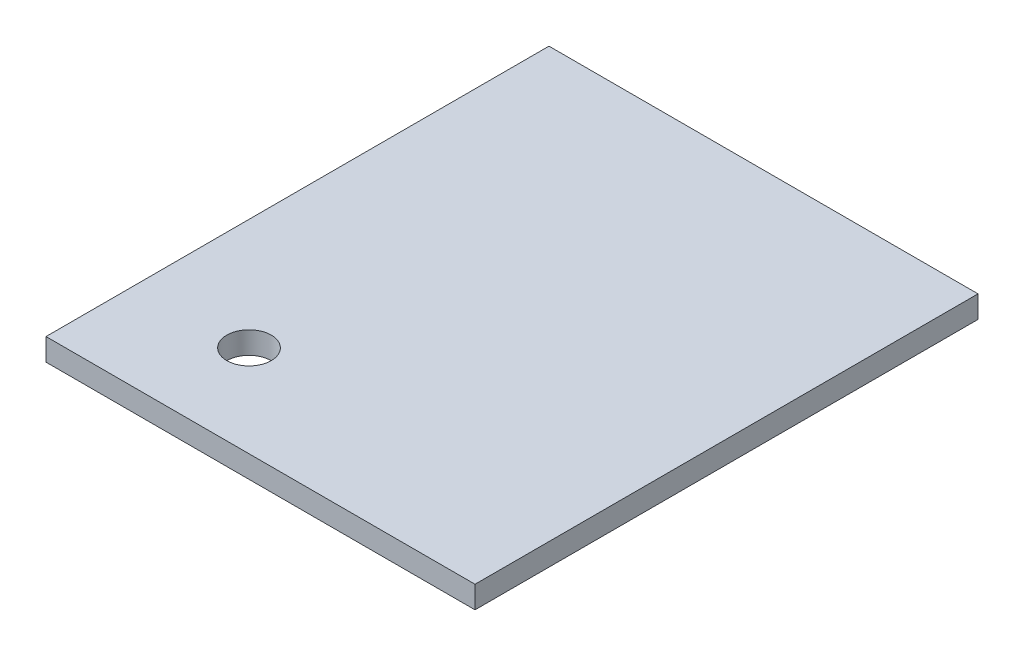
ISO-10303-21;
HEADER;
FILE_DESCRIPTION(('STEP AP214'),'2;1');
FILE_NAME('part.step','',(''),(''),'','','');
FILE_SCHEMA(('AUTOMOTIVE_DESIGN { 1 0 10303 214 1 1 1 1 }'));
ENDSEC;
DATA;
#1=APPLICATION_CONTEXT('core data for automotive mechanical design processes');
#2=APPLICATION_PROTOCOL_DEFINITION('international standard','automotive_design',2000,#1);
#3=PRODUCT_CONTEXT('',#1,'mechanical');
#4=PRODUCT('Part','Part','',(#3));
#5=PRODUCT_RELATED_PRODUCT_CATEGORY('part','',(#4));
#6=PRODUCT_DEFINITION_FORMATION('','',#4);
#7=PRODUCT_DEFINITION_CONTEXT('part definition',#1,'design');
#8=PRODUCT_DEFINITION('design','',#6,#7);
#9=PRODUCT_DEFINITION_SHAPE('','',#8);
#10=(LENGTH_UNIT() NAMED_UNIT(*) SI_UNIT(.MILLI.,.METRE.));
#11=(NAMED_UNIT(*) PLANE_ANGLE_UNIT() SI_UNIT($,.RADIAN.));
#12=(NAMED_UNIT(*) SI_UNIT($,.STERADIAN.) SOLID_ANGLE_UNIT());
#13=UNCERTAINTY_MEASURE_WITH_UNIT(LENGTH_MEASURE(1.E-05),#10,'distance_accuracy_value','');
#14=(GEOMETRIC_REPRESENTATION_CONTEXT(3) GLOBAL_UNCERTAINTY_ASSIGNED_CONTEXT((#13)) GLOBAL_UNIT_ASSIGNED_CONTEXT((#10,
#11,#12)) REPRESENTATION_CONTEXT('',''));
#15=CARTESIAN_POINT('',(0.,0.,0.));
#16=DIRECTION('',(0.,0.,1.));
#17=DIRECTION('',(1.,0.,0.));
#18=AXIS2_PLACEMENT_3D('',#15,#16,#17);
#19=CARTESIAN_POINT('',(-26.3685789469399,3.,-11.4411281551357));
#20=DIRECTION('',(1.,0.,0.));
#21=DIRECTION('',(0.,0.,-1.));
#22=AXIS2_PLACEMENT_3D('',#19,#20,#21);
#23=PLANE('',#22);
#24=DIRECTION('',(0.,0.,1.));
#25=VECTOR('',#24,1.);
#26=CARTESIAN_POINT('',(-26.3685789469399,0.,-11.4411281551357));
#27=LINE('',#26,#25);
#28=CARTESIAN_POINT('',(-26.3685789469399,0.,-11.4411281551357));
#29=VERTEX_POINT('',#28);
#30=CARTESIAN_POINT('',(-26.3685789469398,0.,56.5588718448644));
#31=VERTEX_POINT('',#30);
#32=EDGE_CURVE('E101',#29,#31,#27,.T.);
#33=ORIENTED_EDGE('',*,*,#32,.T.);
#34=DIRECTION('',(0.,-1.,0.));
#35=VECTOR('',#34,1.);
#36=CARTESIAN_POINT('',(-26.3685789469398,3.,56.5588718448644));
#37=LINE('',#36,#35);
#38=CARTESIAN_POINT('',(-26.3685789469398,3.,56.5588718448644));
#39=VERTEX_POINT('',#38);
#40=EDGE_CURVE('E11',#39,#31,#37,.T.);
#41=ORIENTED_EDGE('',*,*,#40,.F.);
#42=DIRECTION('',(0.,0.,1.));
#43=VECTOR('',#42,1.);
#44=CARTESIAN_POINT('',(-26.3685789469399,3.,-11.4411281551357));
#45=LINE('',#44,#43);
#46=CARTESIAN_POINT('',(-26.3685789469399,3.,-11.4411281551357));
#47=VERTEX_POINT('',#46);
#48=EDGE_CURVE('E89',#47,#39,#45,.T.);
#49=ORIENTED_EDGE('',*,*,#48,.F.);
#50=DIRECTION('',(0.,-1.,0.));
#51=VECTOR('',#50,1.);
#52=CARTESIAN_POINT('',(-26.3685789469399,3.,-11.4411281551357));
#53=LINE('',#52,#51);
#54=EDGE_CURVE('E97',#47,#29,#53,.T.);
#55=ORIENTED_EDGE('',*,*,#54,.T.);
#56=EDGE_LOOP('',(#33,#41,#49,#55));
#57=FACE_BOUND('',#56,.T.);
#58=ADVANCED_FACE('F38',(#57),#23,.F.);
#59=CARTESIAN_POINT('',(-26.3685789469398,3.,56.5588718448644));
#60=DIRECTION('',(0.,0.,-1.));
#61=DIRECTION('',(-1.,0.,0.));
#62=AXIS2_PLACEMENT_3D('',#59,#60,#61);
#63=PLANE('',#62);
#64=DIRECTION('',(1.,0.,0.));
#65=VECTOR('',#64,1.);
#66=CARTESIAN_POINT('',(-26.3685789469398,0.,56.5588718448644));
#67=LINE('',#66,#65);
#68=CARTESIAN_POINT('',(31.6314210530602,0.,56.5588718448644));
#69=VERTEX_POINT('',#68);
#70=EDGE_CURVE('E93',#31,#69,#67,.T.);
#71=ORIENTED_EDGE('',*,*,#70,.T.);
#72=DIRECTION('',(0.,-1.,0.));
#73=VECTOR('',#72,1.);
#74=CARTESIAN_POINT('',(31.6314210530602,3.,56.5588718448644));
#75=LINE('',#74,#73);
#76=CARTESIAN_POINT('',(31.6314210530602,3.,56.5588718448644));
#77=VERTEX_POINT('',#76);
#78=EDGE_CURVE('E46',#77,#69,#75,.T.);
#79=ORIENTED_EDGE('',*,*,#78,.F.);
#80=DIRECTION('',(1.,0.,0.));
#81=VECTOR('',#80,1.);
#82=CARTESIAN_POINT('',(-26.3685789469398,3.,56.5588718448644));
#83=LINE('',#82,#81);
#84=EDGE_CURVE('E84',#39,#77,#83,.T.);
#85=ORIENTED_EDGE('',*,*,#84,.F.);
#86=ORIENTED_EDGE('',*,*,#40,.T.);
#87=EDGE_LOOP('',(#71,#79,#85,#86));
#88=FACE_BOUND('',#87,.T.);
#89=ADVANCED_FACE('F92',(#88),#63,.F.);
#90=CARTESIAN_POINT('',(31.6314210530602,3.,-11.4411281551357));
#91=DIRECTION('',(-1.,0.,0.));
#92=DIRECTION('',(0.,0.,1.));
#93=AXIS2_PLACEMENT_3D('',#90,#91,#92);
#94=PLANE('',#93);
#95=DIRECTION('',(0.,0.,-1.));
#96=VECTOR('',#95,1.);
#97=CARTESIAN_POINT('',(31.6314210530602,0.,-11.4411281551357));
#98=LINE('',#97,#96);
#99=CARTESIAN_POINT('',(31.6314210530602,0.,-11.4411281551357));
#100=VERTEX_POINT('',#99);
#101=EDGE_CURVE('E71',#69,#100,#98,.T.);
#102=ORIENTED_EDGE('',*,*,#101,.T.);
#103=DIRECTION('',(0.,-1.,0.));
#104=VECTOR('',#103,1.);
#105=CARTESIAN_POINT('',(31.6314210530602,3.,-11.4411281551357));
#106=LINE('',#105,#104);
#107=CARTESIAN_POINT('',(31.6314210530602,3.,-11.4411281551357));
#108=VERTEX_POINT('',#107);
#109=EDGE_CURVE('E94',#108,#100,#106,.T.);
#110=ORIENTED_EDGE('',*,*,#109,.F.);
#111=DIRECTION('',(0.,0.,-1.));
#112=VECTOR('',#111,1.);
#113=CARTESIAN_POINT('',(31.6314210530602,3.,-11.4411281551357));
#114=LINE('',#113,#112);
#115=EDGE_CURVE('E87',#77,#108,#114,.T.);
#116=ORIENTED_EDGE('',*,*,#115,.F.);
#117=ORIENTED_EDGE('',*,*,#78,.T.);
#118=EDGE_LOOP('',(#102,#110,#116,#117));
#119=FACE_BOUND('',#118,.T.);
#120=ADVANCED_FACE('F95',(#119),#94,.F.);
#121=CARTESIAN_POINT('',(-26.3685789469399,3.,-11.4411281551357));
#122=DIRECTION('',(0.,0.,1.));
#123=DIRECTION('',(1.,0.,0.));
#124=AXIS2_PLACEMENT_3D('',#121,#122,#123);
#125=PLANE('',#124);
#126=DIRECTION('',(-1.,0.,0.));
#127=VECTOR('',#126,1.);
#128=CARTESIAN_POINT('',(-26.3685789469399,0.,-11.4411281551357));
#129=LINE('',#128,#127);
#130=EDGE_CURVE('E77',#100,#29,#129,.T.);
#131=ORIENTED_EDGE('',*,*,#130,.T.);
#132=ORIENTED_EDGE('',*,*,#54,.F.);
#133=DIRECTION('',(-1.,0.,0.));
#134=VECTOR('',#133,1.);
#135=CARTESIAN_POINT('',(-26.3685789469399,3.,-11.4411281551357));
#136=LINE('',#135,#134);
#137=EDGE_CURVE('E54',#108,#47,#136,.T.);
#138=ORIENTED_EDGE('',*,*,#137,.F.);
#139=ORIENTED_EDGE('',*,*,#109,.T.);
#140=EDGE_LOOP('',(#131,#132,#138,#139));
#141=FACE_BOUND('',#140,.T.);
#142=ADVANCED_FACE('F109',(#141),#125,.F.);
#143=CARTESIAN_POINT('',(0.,3.,0.));
#144=DIRECTION('',(0.,1.,0.));
#145=DIRECTION('',(0.,0.,1.));
#146=AXIS2_PLACEMENT_3D('',#143,#144,#145);
#147=PLANE('',#146);
#148=CARTESIAN_POINT('',(-11.3197436361269,3.,44.1599965979873));
#149=DIRECTION('',(0.,1.,0.));
#150=DIRECTION('',(0.,0.,1.));
#151=AXIS2_PLACEMENT_3D('',#148,#149,#150);
#152=CIRCLE('',#151,3.);
#153=CARTESIAN_POINT('',(-11.3197436361269,3.,47.1599965979873));
#154=VERTEX_POINT('',#153);
#155=EDGE_CURVE('E104',#154,#154,#152,.T.);
#156=ORIENTED_EDGE('',*,*,#155,.F.);
#157=EDGE_LOOP('',(#156));
#158=FACE_BOUND('',#157,.T.);
#159=ORIENTED_EDGE('',*,*,#48,.T.);
#160=ORIENTED_EDGE('',*,*,#84,.T.);
#161=ORIENTED_EDGE('',*,*,#115,.T.);
#162=ORIENTED_EDGE('',*,*,#137,.T.);
#163=EDGE_LOOP('',(#159,#160,#161,#162));
#164=FACE_BOUND('',#163,.T.);
#165=ADVANCED_FACE('F85',(#158,#164),#147,.T.);
#166=CARTESIAN_POINT('',(0.,0.,0.));
#167=DIRECTION('',(0.,1.,0.));
#168=DIRECTION('',(0.,0.,1.));
#169=AXIS2_PLACEMENT_3D('',#166,#167,#168);
#170=PLANE('',#169);
#171=CARTESIAN_POINT('',(-11.3197436361269,0.,44.1599965979873));
#172=DIRECTION('',(0.,-1.,0.));
#173=DIRECTION('',(0.,0.,-1.));
#174=AXIS2_PLACEMENT_3D('',#171,#172,#173);
#175=CIRCLE('',#174,3.);
#176=CARTESIAN_POINT('',(-11.3197436361269,0.,41.1599965979873));
#177=VERTEX_POINT('',#176);
#178=EDGE_CURVE('E117',#177,#177,#175,.T.);
#179=ORIENTED_EDGE('',*,*,#178,.F.);
#180=EDGE_LOOP('',(#179));
#181=FACE_BOUND('',#180,.T.);
#182=ORIENTED_EDGE('',*,*,#32,.F.);
#183=ORIENTED_EDGE('',*,*,#130,.F.);
#184=ORIENTED_EDGE('',*,*,#101,.F.);
#185=ORIENTED_EDGE('',*,*,#70,.F.);
#186=EDGE_LOOP('',(#182,#183,#184,#185));
#187=FACE_BOUND('',#186,.T.);
#188=ADVANCED_FACE('F112',(#181,#187),#170,.F.);
#189=CARTESIAN_POINT('',(-11.3197436361269,0.,44.1599965979873));
#190=DIRECTION('',(0.,-1.,0.));
#191=DIRECTION('',(0.,0.,-1.));
#192=AXIS2_PLACEMENT_3D('',#189,#190,#191);
#193=CYLINDRICAL_SURFACE('',#192,3.);
#194=ORIENTED_EDGE('',*,*,#178,.T.);
#195=EDGE_LOOP('',(#194));
#196=FACE_BOUND('',#195,.T.);
#197=ORIENTED_EDGE('',*,*,#155,.T.);
#198=EDGE_LOOP('',(#197));
#199=FACE_BOUND('',#198,.T.);
#200=ADVANCED_FACE('F121',(#196,#199),#193,.F.);
#201=CLOSED_SHELL('',(#58,#89,#120,#142,#165,#188,#200));
#202=MANIFOLD_SOLID_BREP('B2',#201);
#203=ADVANCED_BREP_SHAPE_REPRESENTATION('',(#18,#202),#14);
#204=SHAPE_DEFINITION_REPRESENTATION(#9,#203);
ENDSEC;
END-ISO-10303-21;
